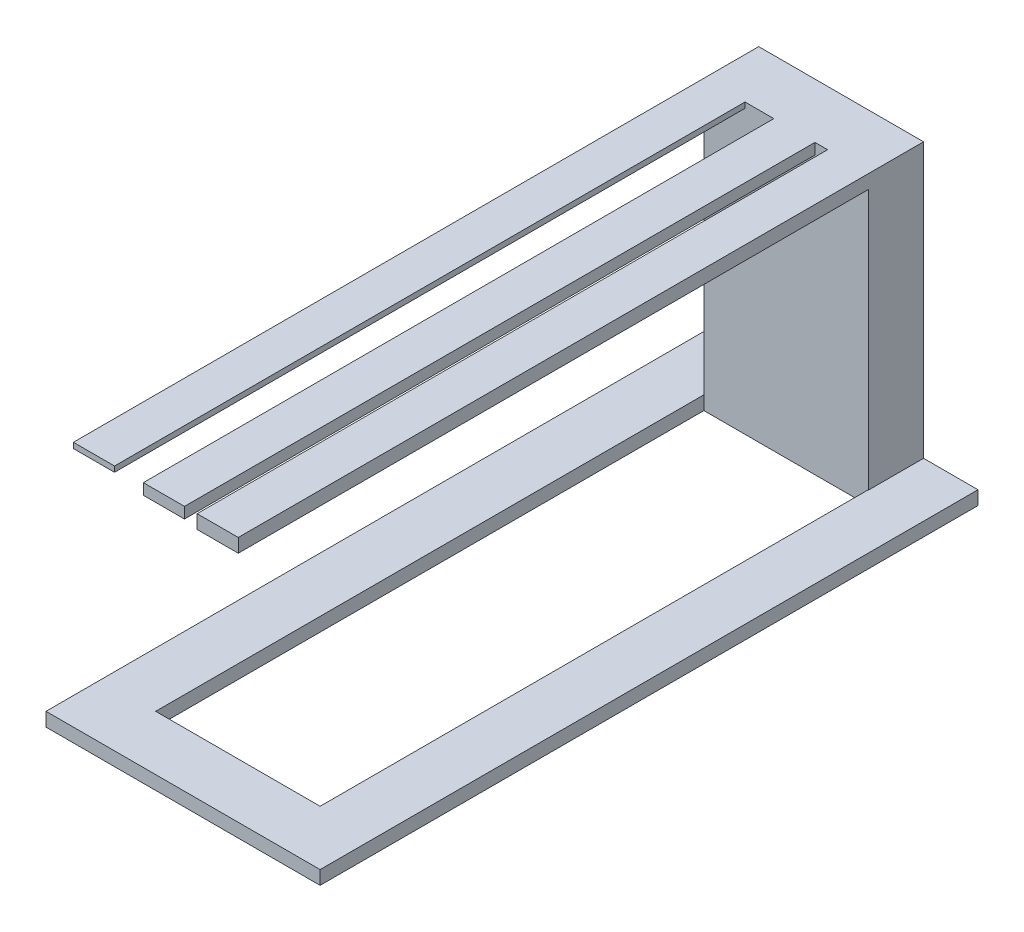
ISO-10303-21;
HEADER;
FILE_DESCRIPTION(('STEP AP214'),'2;1');
FILE_NAME('part.step','',(''),(''),'','','');
FILE_SCHEMA(('AUTOMOTIVE_DESIGN { 1 0 10303 214 1 1 1 1 }'));
ENDSEC;
DATA;
#1=APPLICATION_CONTEXT('core data for automotive mechanical design processes');
#2=APPLICATION_PROTOCOL_DEFINITION('international standard','automotive_design',2000,#1);
#3=PRODUCT_CONTEXT('',#1,'mechanical');
#4=PRODUCT('Part','Part','',(#3));
#5=PRODUCT_RELATED_PRODUCT_CATEGORY('part','',(#4));
#6=PRODUCT_DEFINITION_FORMATION('','',#4);
#7=PRODUCT_DEFINITION_CONTEXT('part definition',#1,'design');
#8=PRODUCT_DEFINITION('design','',#6,#7);
#9=PRODUCT_DEFINITION_SHAPE('','',#8);
#10=(LENGTH_UNIT() NAMED_UNIT(*) SI_UNIT(.MILLI.,.METRE.));
#11=(NAMED_UNIT(*) PLANE_ANGLE_UNIT() SI_UNIT($,.RADIAN.));
#12=(NAMED_UNIT(*) SI_UNIT($,.STERADIAN.) SOLID_ANGLE_UNIT());
#13=UNCERTAINTY_MEASURE_WITH_UNIT(LENGTH_MEASURE(1.E-05),#10,'distance_accuracy_value','');
#14=(GEOMETRIC_REPRESENTATION_CONTEXT(3) GLOBAL_UNCERTAINTY_ASSIGNED_CONTEXT((#13)) GLOBAL_UNIT_ASSIGNED_CONTEXT((#10,
#11,#12)) REPRESENTATION_CONTEXT('',''));
#15=CARTESIAN_POINT('',(0.,0.,0.));
#16=DIRECTION('',(0.,0.,1.));
#17=DIRECTION('',(1.,0.,0.));
#18=AXIS2_PLACEMENT_3D('',#15,#16,#17);
#19=CARTESIAN_POINT('',(0.,5.,-19.4817184539535));
#20=DIRECTION('',(0.,0.,-1.));
#21=DIRECTION('',(-1.,0.,0.));
#22=AXIS2_PLACEMENT_3D('',#19,#20,#21);
#23=PLANE('',#22);
#24=DIRECTION('',(0.,1.,0.));
#25=VECTOR('',#24,1.);
#26=CARTESIAN_POINT('',(13.2134003903269,105.,-19.4817184539535));
#27=LINE('',#26,#25);
#28=CARTESIAN_POINT('',(13.2134003903269,101.,-19.4817184539535));
#29=VERTEX_POINT('',#28);
#30=CARTESIAN_POINT('',(13.2134003903269,105.,-19.4817184539535));
#31=VERTEX_POINT('',#30);
#32=EDGE_CURVE('E58',#29,#31,#27,.T.);
#33=ORIENTED_EDGE('',*,*,#32,.F.);
#34=DIRECTION('',(1.,0.,0.));
#35=VECTOR('',#34,1.);
#36=CARTESIAN_POINT('',(13.2134003903269,101.,-19.4817184539535));
#37=LINE('',#36,#35);
#38=CARTESIAN_POINT('',(-1.78659960967309,101.,-19.4817184539535));
#39=VERTEX_POINT('',#38);
#40=EDGE_CURVE('E194',#39,#29,#37,.T.);
#41=ORIENTED_EDGE('',*,*,#40,.F.);
#42=DIRECTION('',(0.,-1.,0.));
#43=VECTOR('',#42,1.);
#44=CARTESIAN_POINT('',(-1.78659960967309,105.,-19.4817184539535));
#45=LINE('',#44,#43);
#46=CARTESIAN_POINT('',(-1.78659960967309,105.,-19.4817184539535));
#47=VERTEX_POINT('',#46);
#48=EDGE_CURVE('E203',#47,#39,#45,.T.);
#49=ORIENTED_EDGE('',*,*,#48,.F.);
#50=DIRECTION('',(1.,0.,0.));
#51=VECTOR('',#50,1.);
#52=CARTESIAN_POINT('',(-27.2996300863132,105.,-19.4817184539535));
#53=LINE('',#52,#51);
#54=CARTESIAN_POINT('',(-12.2996300863132,105.,-19.4817184539535));
#55=VERTEX_POINT('',#54);
#56=EDGE_CURVE('E268',#55,#47,#53,.T.);
#57=ORIENTED_EDGE('',*,*,#56,.F.);
#58=DIRECTION('',(0.,1.,0.));
#59=VECTOR('',#58,1.);
#60=CARTESIAN_POINT('',(-12.2996300863132,105.,-19.4817184539535));
#61=LINE('',#60,#59);
#62=CARTESIAN_POINT('',(-12.2996300863132,103.,-19.4817184539535));
#63=VERTEX_POINT('',#62);
#64=EDGE_CURVE('E249',#63,#55,#61,.T.);
#65=ORIENTED_EDGE('',*,*,#64,.F.);
#66=DIRECTION('',(1.,0.,0.));
#67=VECTOR('',#66,1.);
#68=CARTESIAN_POINT('',(-27.2996300863132,103.,-19.4817184539535));
#69=LINE('',#68,#67);
#70=CARTESIAN_POINT('',(-27.2996300863132,103.,-19.4817184539535));
#71=VERTEX_POINT('',#70);
#72=EDGE_CURVE('E237',#71,#63,#69,.T.);
#73=ORIENTED_EDGE('',*,*,#72,.F.);
#74=DIRECTION('',(0.,-1.,0.));
#75=VECTOR('',#74,1.);
#76=CARTESIAN_POINT('',(-27.2996300863132,105.,-19.4817184539535));
#77=LINE('',#76,#75);
#78=CARTESIAN_POINT('',(-27.2996300863132,5.,-19.4817184539535));
#79=VERTEX_POINT('',#78);
#80=EDGE_CURVE('E286',#71,#79,#77,.T.);
#81=ORIENTED_EDGE('',*,*,#80,.T.);
#82=DIRECTION('',(0.,-1.,0.));
#83=VECTOR('',#82,1.);
#84=CARTESIAN_POINT('',(-27.2996300863132,5.,-19.4817184539535));
#85=LINE('',#84,#83);
#86=CARTESIAN_POINT('',(-27.2996300863132,0.,-19.4817184539535));
#87=VERTEX_POINT('',#86);
#88=EDGE_CURVE('E336',#79,#87,#85,.T.);
#89=ORIENTED_EDGE('',*,*,#88,.T.);
#90=DIRECTION('',(1.,0.,0.));
#91=VECTOR('',#90,1.);
#92=CARTESIAN_POINT('',(0.,0.,-19.4817184539535));
#93=LINE('',#92,#91);
#94=CARTESIAN_POINT('',(32.7003699136868,0.,-19.4817184539535));
#95=VERTEX_POINT('',#94);
#96=EDGE_CURVE('E326',#87,#95,#93,.T.);
#97=ORIENTED_EDGE('',*,*,#96,.T.);
#98=DIRECTION('',(0.,-1.,0.));
#99=VECTOR('',#98,1.);
#100=CARTESIAN_POINT('',(32.7003699136868,5.,-19.4817184539535));
#101=LINE('',#100,#99);
#102=CARTESIAN_POINT('',(32.7003699136868,5.,-19.4817184539535));
#103=VERTEX_POINT('',#102);
#104=EDGE_CURVE('E333',#103,#95,#101,.T.);
#105=ORIENTED_EDGE('',*,*,#104,.F.);
#106=DIRECTION('',(1.,0.,0.));
#107=VECTOR('',#106,1.);
#108=CARTESIAN_POINT('',(-27.2996300863132,5.,-19.4817184539535));
#109=LINE('',#108,#107);
#110=CARTESIAN_POINT('',(32.8370645417085,5.,-19.4817184539535));
#111=VERTEX_POINT('',#110);
#112=EDGE_CURVE('E11',#103,#111,#109,.T.);
#113=ORIENTED_EDGE('',*,*,#112,.T.);
#114=DIRECTION('',(0.,-1.,0.));
#115=VECTOR('',#114,1.);
#116=CARTESIAN_POINT('',(32.8370645417085,105.,-19.4817184539535));
#117=LINE('',#116,#115);
#118=CARTESIAN_POINT('',(32.8370645417085,100.,-19.4817184539535));
#119=VERTEX_POINT('',#118);
#120=EDGE_CURVE('E284',#119,#111,#117,.T.);
#121=ORIENTED_EDGE('',*,*,#120,.F.);
#122=DIRECTION('',(1.,0.,0.));
#123=VECTOR('',#122,1.);
#124=CARTESIAN_POINT('',(32.8370645417085,100.,-19.4817184539535));
#125=LINE('',#124,#123);
#126=CARTESIAN_POINT('',(17.8370645417085,100.,-19.4817184539535));
#127=VERTEX_POINT('',#126);
#128=EDGE_CURVE('E232',#127,#119,#125,.T.);
#129=ORIENTED_EDGE('',*,*,#128,.F.);
#130=DIRECTION('',(0.,-1.,0.));
#131=VECTOR('',#130,1.);
#132=CARTESIAN_POINT('',(17.8370645417085,105.,-19.4817184539535));
#133=LINE('',#132,#131);
#134=CARTESIAN_POINT('',(17.8370645417085,105.,-19.4817184539535));
#135=VERTEX_POINT('',#134);
#136=EDGE_CURVE('E234',#135,#127,#133,.T.);
#137=ORIENTED_EDGE('',*,*,#136,.F.);
#138=EDGE_CURVE('E212',#31,#135,#53,.T.);
#139=ORIENTED_EDGE('',*,*,#138,.F.);
#140=EDGE_LOOP('',(#33,#41,#49,#57,#65,#73,#81,#89,#97,#105,#113,#121,#129,#137,#139));
#141=FACE_BOUND('',#140,.T.);
#142=ADVANCED_FACE('F41',(#141),#23,.F.);
#143=CARTESIAN_POINT('',(0.,5.,180.518281546047));
#144=DIRECTION('',(0.,0.,-1.));
#145=DIRECTION('',(-1.,0.,0.));
#146=AXIS2_PLACEMENT_3D('',#143,#144,#145);
#147=PLANE('',#146);
#148=DIRECTION('',(1.,0.,0.));
#149=VECTOR('',#148,1.);
#150=CARTESIAN_POINT('',(0.,0.,180.518281546047));
#151=LINE('',#150,#149);
#152=CARTESIAN_POINT('',(-27.2996300863132,0.,180.518281546047));
#153=VERTEX_POINT('',#152);
#154=CARTESIAN_POINT('',(32.7003699136868,0.,180.518281546047));
#155=VERTEX_POINT('',#154);
#156=EDGE_CURVE('E320',#153,#155,#151,.T.);
#157=ORIENTED_EDGE('',*,*,#156,.F.);
#158=DIRECTION('',(0.,-1.,0.));
#159=VECTOR('',#158,1.);
#160=CARTESIAN_POINT('',(-27.2996300863132,5.,180.518281546047));
#161=LINE('',#160,#159);
#162=CARTESIAN_POINT('',(-27.2996300863132,5.,180.518281546047));
#163=VERTEX_POINT('',#162);
#164=EDGE_CURVE('E50',#163,#153,#161,.T.);
#165=ORIENTED_EDGE('',*,*,#164,.F.);
#166=DIRECTION('',(1.,0.,0.));
#167=VECTOR('',#166,1.);
#168=CARTESIAN_POINT('',(0.,5.,180.518281546047));
#169=LINE('',#168,#167);
#170=CARTESIAN_POINT('',(32.7003699136868,5.,180.518281546047));
#171=VERTEX_POINT('',#170);
#172=EDGE_CURVE('E301',#163,#171,#169,.T.);
#173=ORIENTED_EDGE('',*,*,#172,.T.);
#174=DIRECTION('',(0.,-1.,0.));
#175=VECTOR('',#174,1.);
#176=CARTESIAN_POINT('',(32.7003699136868,5.,180.518281546047));
#177=LINE('',#176,#175);
#178=EDGE_CURVE('E331',#171,#155,#177,.T.);
#179=ORIENTED_EDGE('',*,*,#178,.T.);
#180=EDGE_LOOP('',(#157,#165,#173,#179));
#181=FACE_BOUND('',#180,.T.);
#182=ADVANCED_FACE('F428',(#181),#147,.T.);
#183=CARTESIAN_POINT('',(-27.2996300863132,5.,0.));
#184=DIRECTION('',(1.,0.,0.));
#185=DIRECTION('',(0.,0.,-1.));
#186=AXIS2_PLACEMENT_3D('',#183,#184,#185);
#187=PLANE('',#186);
#188=DIRECTION('',(0.,0.,1.));
#189=VECTOR('',#188,1.);
#190=CARTESIAN_POINT('',(-27.2996300863132,0.,0.));
#191=LINE('',#190,#189);
#192=EDGE_CURVE('E323',#87,#153,#191,.T.);
#193=ORIENTED_EDGE('',*,*,#192,.F.);
#194=ORIENTED_EDGE('',*,*,#88,.F.);
#195=DIRECTION('',(0.,0.,1.));
#196=VECTOR('',#195,1.);
#197=CARTESIAN_POINT('',(-27.2996300863132,5.,0.));
#198=LINE('',#197,#196);
#199=EDGE_CURVE('E304',#79,#163,#198,.T.);
#200=ORIENTED_EDGE('',*,*,#199,.T.);
#201=ORIENTED_EDGE('',*,*,#164,.T.);
#202=EDGE_LOOP('',(#193,#194,#200,#201));
#203=FACE_BOUND('',#202,.T.);
#204=ADVANCED_FACE('F426',(#203),#187,.T.);
#205=CARTESIAN_POINT('',(-47.2996300863132,5.,0.));
#206=DIRECTION('',(1.,0.,0.));
#207=DIRECTION('',(0.,0.,-1.));
#208=AXIS2_PLACEMENT_3D('',#205,#206,#207);
#209=PLANE('',#208);
#210=DIRECTION('',(0.,0.,1.));
#211=VECTOR('',#210,1.);
#212=CARTESIAN_POINT('',(-47.2996300863132,0.,0.));
#213=LINE('',#212,#211);
#214=CARTESIAN_POINT('',(-47.2996300863132,0.,-39.4817184539535));
#215=VERTEX_POINT('',#214);
#216=CARTESIAN_POINT('',(-47.2996300863132,0.,200.518281546047));
#217=VERTEX_POINT('',#216);
#218=EDGE_CURVE('E288',#215,#217,#213,.T.);
#219=ORIENTED_EDGE('',*,*,#218,.T.);
#220=DIRECTION('',(0.,-1.,0.));
#221=VECTOR('',#220,1.);
#222=CARTESIAN_POINT('',(-47.2996300863132,5.,200.518281546047));
#223=LINE('',#222,#221);
#224=CARTESIAN_POINT('',(-47.2996300863132,5.,200.518281546047));
#225=VERTEX_POINT('',#224);
#226=EDGE_CURVE('E45',#225,#217,#223,.T.);
#227=ORIENTED_EDGE('',*,*,#226,.F.);
#228=DIRECTION('',(0.,0.,1.));
#229=VECTOR('',#228,1.);
#230=CARTESIAN_POINT('',(-47.2996300863132,5.,0.));
#231=LINE('',#230,#229);
#232=CARTESIAN_POINT('',(-47.2996300863132,5.,-39.4817184539535));
#233=VERTEX_POINT('',#232);
#234=EDGE_CURVE('E289',#233,#225,#231,.T.);
#235=ORIENTED_EDGE('',*,*,#234,.F.);
#236=DIRECTION('',(0.,-1.,0.));
#237=VECTOR('',#236,1.);
#238=CARTESIAN_POINT('',(-47.2996300863132,5.,-39.4817184539535));
#239=LINE('',#238,#237);
#240=EDGE_CURVE('E309',#233,#215,#239,.T.);
#241=ORIENTED_EDGE('',*,*,#240,.T.);
#242=EDGE_LOOP('',(#219,#227,#235,#241));
#243=FACE_BOUND('',#242,.T.);
#244=ADVANCED_FACE('F43',(#243),#209,.F.);
#245=CARTESIAN_POINT('',(0.,5.,200.518281546047));
#246=DIRECTION('',(0.,0.,1.));
#247=DIRECTION('',(1.,0.,0.));
#248=AXIS2_PLACEMENT_3D('',#245,#246,#247);
#249=PLANE('',#248);
#250=DIRECTION('',(-1.,0.,0.));
#251=VECTOR('',#250,1.);
#252=CARTESIAN_POINT('',(0.,0.,200.518281546047));
#253=LINE('',#252,#251);
#254=CARTESIAN_POINT('',(52.7003699136868,0.,200.518281546047));
#255=VERTEX_POINT('',#254);
#256=EDGE_CURVE('E312',#255,#217,#253,.T.);
#257=ORIENTED_EDGE('',*,*,#256,.F.);
#258=DIRECTION('',(0.,-1.,0.));
#259=VECTOR('',#258,1.);
#260=CARTESIAN_POINT('',(52.7003699136868,5.,200.518281546047));
#261=LINE('',#260,#259);
#262=CARTESIAN_POINT('',(52.7003699136868,5.,200.518281546047));
#263=VERTEX_POINT('',#262);
#264=EDGE_CURVE('E342',#263,#255,#261,.T.);
#265=ORIENTED_EDGE('',*,*,#264,.F.);
#266=DIRECTION('',(-1.,0.,0.));
#267=VECTOR('',#266,1.);
#268=CARTESIAN_POINT('',(0.,5.,200.518281546047));
#269=LINE('',#268,#267);
#270=EDGE_CURVE('E291',#263,#225,#269,.T.);
#271=ORIENTED_EDGE('',*,*,#270,.T.);
#272=ORIENTED_EDGE('',*,*,#226,.T.);
#273=EDGE_LOOP('',(#257,#265,#271,#272));
#274=FACE_BOUND('',#273,.T.);
#275=ADVANCED_FACE('F348',(#274),#249,.T.);
#276=CARTESIAN_POINT('',(52.7003699136868,5.,0.));
#277=DIRECTION('',(1.,0.,0.));
#278=DIRECTION('',(0.,0.,-1.));
#279=AXIS2_PLACEMENT_3D('',#276,#277,#278);
#280=PLANE('',#279);
#281=DIRECTION('',(0.,0.,1.));
#282=VECTOR('',#281,1.);
#283=CARTESIAN_POINT('',(52.7003699136868,0.,0.));
#284=LINE('',#283,#282);
#285=CARTESIAN_POINT('',(52.7003699136868,0.,-39.4817184539535));
#286=VERTEX_POINT('',#285);
#287=EDGE_CURVE('E315',#286,#255,#284,.T.);
#288=ORIENTED_EDGE('',*,*,#287,.F.);
#289=DIRECTION('',(0.,-1.,0.));
#290=VECTOR('',#289,1.);
#291=CARTESIAN_POINT('',(52.7003699136868,5.,-39.4817184539535));
#292=LINE('',#291,#290);
#293=CARTESIAN_POINT('',(52.7003699136868,5.,-39.4817184539535));
#294=VERTEX_POINT('',#293);
#295=EDGE_CURVE('E341',#294,#286,#292,.T.);
#296=ORIENTED_EDGE('',*,*,#295,.F.);
#297=DIRECTION('',(0.,0.,1.));
#298=VECTOR('',#297,1.);
#299=CARTESIAN_POINT('',(52.7003699136868,5.,0.));
#300=LINE('',#299,#298);
#301=EDGE_CURVE('E295',#294,#263,#300,.T.);
#302=ORIENTED_EDGE('',*,*,#301,.T.);
#303=ORIENTED_EDGE('',*,*,#264,.T.);
#304=EDGE_LOOP('',(#288,#296,#302,#303));
#305=FACE_BOUND('',#304,.T.);
#306=ADVANCED_FACE('F358',(#305),#280,.T.);
#307=CARTESIAN_POINT('',(0.,5.,-39.4817184539535));
#308=DIRECTION('',(0.,0.,1.));
#309=DIRECTION('',(1.,0.,0.));
#310=AXIS2_PLACEMENT_3D('',#307,#308,#309);
#311=PLANE('',#310);
#312=DIRECTION('',(-1.,0.,0.));
#313=VECTOR('',#312,1.);
#314=CARTESIAN_POINT('',(0.,0.,-39.4817184539535));
#315=LINE('',#314,#313);
#316=EDGE_CURVE('E318',#286,#215,#315,.T.);
#317=ORIENTED_EDGE('',*,*,#316,.T.);
#318=ORIENTED_EDGE('',*,*,#240,.F.);
#319=DIRECTION('',(-1.,0.,0.));
#320=VECTOR('',#319,1.);
#321=CARTESIAN_POINT('',(0.,5.,-39.4817184539535));
#322=LINE('',#321,#320);
#323=CARTESIAN_POINT('',(-27.2996300863132,5.,-39.4817184539535));
#324=VERTEX_POINT('',#323);
#325=EDGE_CURVE('E298',#324,#233,#322,.T.);
#326=ORIENTED_EDGE('',*,*,#325,.F.);
#327=DIRECTION('',(0.,-1.,0.));
#328=VECTOR('',#327,1.);
#329=CARTESIAN_POINT('',(-27.2996300863132,105.,-39.4817184539535));
#330=LINE('',#329,#328);
#331=CARTESIAN_POINT('',(-27.2996300863132,105.,-39.4817184539535));
#332=VERTEX_POINT('',#331);
#333=EDGE_CURVE('E274',#332,#324,#330,.T.);
#334=ORIENTED_EDGE('',*,*,#333,.F.);
#335=DIRECTION('',(-1.,0.,0.));
#336=VECTOR('',#335,1.);
#337=CARTESIAN_POINT('',(-27.2996300863132,105.,-39.4817184539535));
#338=LINE('',#337,#336);
#339=CARTESIAN_POINT('',(32.8370645417085,105.,-39.4817184539535));
#340=VERTEX_POINT('',#339);
#341=EDGE_CURVE('E272',#340,#332,#338,.T.);
#342=ORIENTED_EDGE('',*,*,#341,.F.);
#343=DIRECTION('',(0.,-1.,0.));
#344=VECTOR('',#343,1.);
#345=CARTESIAN_POINT('',(32.8370645417085,105.,-39.4817184539535));
#346=LINE('',#345,#344);
#347=CARTESIAN_POINT('',(32.8370645417085,5.,-39.4817184539535));
#348=VERTEX_POINT('',#347);
#349=EDGE_CURVE('E281',#340,#348,#346,.T.);
#350=ORIENTED_EDGE('',*,*,#349,.T.);
#351=EDGE_CURVE('E299',#294,#348,#322,.T.);
#352=ORIENTED_EDGE('',*,*,#351,.F.);
#353=ORIENTED_EDGE('',*,*,#295,.T.);
#354=EDGE_LOOP('',(#317,#318,#326,#334,#342,#350,#352,#353));
#355=FACE_BOUND('',#354,.T.);
#356=ADVANCED_FACE('F362',(#355),#311,.F.);
#357=CARTESIAN_POINT('',(32.7003699136868,5.,0.));
#358=DIRECTION('',(1.,0.,0.));
#359=DIRECTION('',(0.,0.,-1.));
#360=AXIS2_PLACEMENT_3D('',#357,#358,#359);
#361=PLANE('',#360);
#362=DIRECTION('',(0.,0.,1.));
#363=VECTOR('',#362,1.);
#364=CARTESIAN_POINT('',(32.7003699136868,0.,0.));
#365=LINE('',#364,#363);
#366=EDGE_CURVE('E292',#95,#155,#365,.T.);
#367=ORIENTED_EDGE('',*,*,#366,.T.);
#368=ORIENTED_EDGE('',*,*,#178,.F.);
#369=DIRECTION('',(0.,0.,1.));
#370=VECTOR('',#369,1.);
#371=CARTESIAN_POINT('',(32.7003699136868,5.,0.));
#372=LINE('',#371,#370);
#373=EDGE_CURVE('E307',#103,#171,#372,.T.);
#374=ORIENTED_EDGE('',*,*,#373,.F.);
#375=ORIENTED_EDGE('',*,*,#104,.T.);
#376=EDGE_LOOP('',(#367,#368,#374,#375));
#377=FACE_BOUND('',#376,.T.);
#378=ADVANCED_FACE('F419',(#377),#361,.F.);
#379=CARTESIAN_POINT('',(0.,5.,0.));
#380=DIRECTION('',(0.,1.,0.));
#381=DIRECTION('',(0.,0.,1.));
#382=AXIS2_PLACEMENT_3D('',#379,#380,#381);
#383=PLANE('',#382);
#384=DIRECTION('',(0.,0.,1.));
#385=VECTOR('',#384,1.);
#386=CARTESIAN_POINT('',(-27.2996300863132,5.,-19.4817184539535));
#387=LINE('',#386,#385);
#388=EDGE_CURVE('E264',#324,#79,#387,.T.);
#389=ORIENTED_EDGE('',*,*,#388,.F.);
#390=ORIENTED_EDGE('',*,*,#325,.T.);
#391=ORIENTED_EDGE('',*,*,#234,.T.);
#392=ORIENTED_EDGE('',*,*,#270,.F.);
#393=ORIENTED_EDGE('',*,*,#301,.F.);
#394=ORIENTED_EDGE('',*,*,#351,.T.);
#395=DIRECTION('',(0.,0.,-1.));
#396=VECTOR('',#395,1.);
#397=CARTESIAN_POINT('',(32.8370645417085,5.,-19.4817184539535));
#398=LINE('',#397,#396);
#399=EDGE_CURVE('E267',#111,#348,#398,.T.);
#400=ORIENTED_EDGE('',*,*,#399,.F.);
#401=ORIENTED_EDGE('',*,*,#112,.F.);
#402=ORIENTED_EDGE('',*,*,#373,.T.);
#403=ORIENTED_EDGE('',*,*,#172,.F.);
#404=ORIENTED_EDGE('',*,*,#199,.F.);
#405=EDGE_LOOP('',(#389,#390,#391,#392,#393,#394,#400,#401,#402,#403,#404));
#406=FACE_BOUND('',#405,.T.);
#407=ADVANCED_FACE('F367',(#406),#383,.T.);
#408=CARTESIAN_POINT('',(0.,0.,0.));
#409=DIRECTION('',(0.,1.,0.));
#410=DIRECTION('',(0.,0.,1.));
#411=AXIS2_PLACEMENT_3D('',#408,#409,#410);
#412=PLANE('',#411);
#413=ORIENTED_EDGE('',*,*,#218,.F.);
#414=ORIENTED_EDGE('',*,*,#316,.F.);
#415=ORIENTED_EDGE('',*,*,#287,.T.);
#416=ORIENTED_EDGE('',*,*,#256,.T.);
#417=EDGE_LOOP('',(#413,#414,#415,#416));
#418=FACE_BOUND('',#417,.T.);
#419=ORIENTED_EDGE('',*,*,#156,.T.);
#420=ORIENTED_EDGE('',*,*,#366,.F.);
#421=ORIENTED_EDGE('',*,*,#96,.F.);
#422=ORIENTED_EDGE('',*,*,#192,.T.);
#423=EDGE_LOOP('',(#419,#420,#421,#422));
#424=FACE_BOUND('',#423,.T.);
#425=ADVANCED_FACE('F356',(#418,#424),#412,.F.);
#426=CARTESIAN_POINT('',(-27.2996300863132,105.,-19.4817184539535));
#427=DIRECTION('',(1.,0.,0.));
#428=DIRECTION('',(0.,0.,-1.));
#429=AXIS2_PLACEMENT_3D('',#426,#427,#428);
#430=PLANE('',#429);
#431=ORIENTED_EDGE('',*,*,#388,.T.);
#432=ORIENTED_EDGE('',*,*,#80,.F.);
#433=DIRECTION('',(0.,0.,-1.));
#434=VECTOR('',#433,1.);
#435=CARTESIAN_POINT('',(-27.2996300863132,103.,210.518281546047));
#436=LINE('',#435,#434);
#437=CARTESIAN_POINT('',(-27.2996300863132,103.,210.518281546047));
#438=VERTEX_POINT('',#437);
#439=EDGE_CURVE('E262',#438,#71,#436,.T.);
#440=ORIENTED_EDGE('',*,*,#439,.F.);
#441=DIRECTION('',(0.,-1.,0.));
#442=VECTOR('',#441,1.);
#443=CARTESIAN_POINT('',(-27.2996300863132,105.,210.518281546047));
#444=LINE('',#443,#442);
#445=CARTESIAN_POINT('',(-27.2996300863132,105.,210.518281546047));
#446=VERTEX_POINT('',#445);
#447=EDGE_CURVE('E245',#446,#438,#444,.T.);
#448=ORIENTED_EDGE('',*,*,#447,.F.);
#449=DIRECTION('',(0.,0.,1.));
#450=VECTOR('',#449,1.);
#451=CARTESIAN_POINT('',(-27.2996300863132,105.,-19.4817184539535));
#452=LINE('',#451,#450);
#453=EDGE_CURVE('E265',#332,#446,#452,.T.);
#454=ORIENTED_EDGE('',*,*,#453,.F.);
#455=ORIENTED_EDGE('',*,*,#333,.T.);
#456=EDGE_LOOP('',(#431,#432,#440,#448,#454,#455));
#457=FACE_BOUND('',#456,.T.);
#458=ADVANCED_FACE('F373',(#457),#430,.F.);
#459=CARTESIAN_POINT('',(32.8370645417085,105.,-19.4817184539535));
#460=DIRECTION('',(-1.,0.,0.));
#461=DIRECTION('',(0.,0.,1.));
#462=AXIS2_PLACEMENT_3D('',#459,#460,#461);
#463=PLANE('',#462);
#464=ORIENTED_EDGE('',*,*,#399,.T.);
#465=ORIENTED_EDGE('',*,*,#349,.F.);
#466=DIRECTION('',(0.,0.,-1.));
#467=VECTOR('',#466,1.);
#468=CARTESIAN_POINT('',(32.8370645417085,105.,-19.4817184539535));
#469=LINE('',#468,#467);
#470=CARTESIAN_POINT('',(32.8370645417085,105.,210.518281546047));
#471=VERTEX_POINT('',#470);
#472=EDGE_CURVE('E270',#471,#340,#469,.T.);
#473=ORIENTED_EDGE('',*,*,#472,.F.);
#474=DIRECTION('',(0.,1.,0.));
#475=VECTOR('',#474,1.);
#476=CARTESIAN_POINT('',(32.8370645417085,105.,210.518281546047));
#477=LINE('',#476,#475);
#478=CARTESIAN_POINT('',(32.8370645417085,100.,210.518281546047));
#479=VERTEX_POINT('',#478);
#480=EDGE_CURVE('E235',#479,#471,#477,.T.);
#481=ORIENTED_EDGE('',*,*,#480,.F.);
#482=DIRECTION('',(0.,0.,-1.));
#483=VECTOR('',#482,1.);
#484=CARTESIAN_POINT('',(32.8370645417085,100.,210.518281546047));
#485=LINE('',#484,#483);
#486=EDGE_CURVE('E228',#479,#119,#485,.T.);
#487=ORIENTED_EDGE('',*,*,#486,.T.);
#488=ORIENTED_EDGE('',*,*,#120,.T.);
#489=EDGE_LOOP('',(#464,#465,#473,#481,#487,#488));
#490=FACE_BOUND('',#489,.T.);
#491=ADVANCED_FACE('F412',(#490),#463,.F.);
#492=CARTESIAN_POINT('',(0.,105.,0.));
#493=DIRECTION('',(0.,-1.,0.));
#494=DIRECTION('',(0.,0.,-1.));
#495=AXIS2_PLACEMENT_3D('',#492,#493,#494);
#496=PLANE('',#495);
#497=ORIENTED_EDGE('',*,*,#453,.T.);
#498=DIRECTION('',(-1.,0.,0.));
#499=VECTOR('',#498,1.);
#500=CARTESIAN_POINT('',(-27.2996300863132,105.,210.518281546047));
#501=LINE('',#500,#499);
#502=CARTESIAN_POINT('',(-12.2996300863132,105.,210.518281546047));
#503=VERTEX_POINT('',#502);
#504=EDGE_CURVE('E253',#503,#446,#501,.T.);
#505=ORIENTED_EDGE('',*,*,#504,.F.);
#506=DIRECTION('',(0.,0.,-1.));
#507=VECTOR('',#506,1.);
#508=CARTESIAN_POINT('',(-12.2996300863132,105.,210.518281546047));
#509=LINE('',#508,#507);
#510=EDGE_CURVE('E66',#503,#55,#509,.T.);
#511=ORIENTED_EDGE('',*,*,#510,.T.);
#512=ORIENTED_EDGE('',*,*,#56,.T.);
#513=DIRECTION('',(0.,0.,-1.));
#514=VECTOR('',#513,1.);
#515=CARTESIAN_POINT('',(-1.78659960967309,105.,210.518281546047));
#516=LINE('',#515,#514);
#517=CARTESIAN_POINT('',(-1.78659960967309,105.,210.518281546047));
#518=VERTEX_POINT('',#517);
#519=EDGE_CURVE('E388',#518,#47,#516,.T.);
#520=ORIENTED_EDGE('',*,*,#519,.F.);
#521=DIRECTION('',(-1.,0.,0.));
#522=VECTOR('',#521,1.);
#523=CARTESIAN_POINT('',(13.2134003903269,105.,210.518281546047));
#524=LINE('',#523,#522);
#525=CARTESIAN_POINT('',(13.2134003903269,105.,210.518281546047));
#526=VERTEX_POINT('',#525);
#527=EDGE_CURVE('E223',#526,#518,#524,.T.);
#528=ORIENTED_EDGE('',*,*,#527,.F.);
#529=DIRECTION('',(0.,0.,-1.));
#530=VECTOR('',#529,1.);
#531=CARTESIAN_POINT('',(13.2134003903269,105.,210.518281546047));
#532=LINE('',#531,#530);
#533=EDGE_CURVE('E391',#526,#31,#532,.T.);
#534=ORIENTED_EDGE('',*,*,#533,.T.);
#535=ORIENTED_EDGE('',*,*,#138,.T.);
#536=DIRECTION('',(0.,0.,-1.));
#537=VECTOR('',#536,1.);
#538=CARTESIAN_POINT('',(17.8370645417085,105.,210.518281546047));
#539=LINE('',#538,#537);
#540=CARTESIAN_POINT('',(17.8370645417085,105.,210.518281546047));
#541=VERTEX_POINT('',#540);
#542=EDGE_CURVE('E213',#541,#135,#539,.T.);
#543=ORIENTED_EDGE('',*,*,#542,.F.);
#544=DIRECTION('',(-1.,0.,0.));
#545=VECTOR('',#544,1.);
#546=CARTESIAN_POINT('',(32.8370645417085,105.,210.518281546047));
#547=LINE('',#546,#545);
#548=EDGE_CURVE('E241',#471,#541,#547,.T.);
#549=ORIENTED_EDGE('',*,*,#548,.F.);
#550=ORIENTED_EDGE('',*,*,#472,.T.);
#551=ORIENTED_EDGE('',*,*,#341,.T.);
#552=EDGE_LOOP('',(#497,#505,#511,#512,#520,#528,#534,#535,#543,#549,#550,#551));
#553=FACE_BOUND('',#552,.T.);
#554=ADVANCED_FACE('F377',(#553),#496,.F.);
#555=CARTESIAN_POINT('',(-27.2996300863132,103.,210.518281546047));
#556=DIRECTION('',(0.,1.,0.));
#557=DIRECTION('',(0.,0.,1.));
#558=AXIS2_PLACEMENT_3D('',#555,#556,#557);
#559=PLANE('',#558);
#560=ORIENTED_EDGE('',*,*,#72,.T.);
#561=DIRECTION('',(0.,0.,-1.));
#562=VECTOR('',#561,1.);
#563=CARTESIAN_POINT('',(-12.2996300863132,103.,210.518281546047));
#564=LINE('',#563,#562);
#565=CARTESIAN_POINT('',(-12.2996300863132,103.,210.518281546047));
#566=VERTEX_POINT('',#565);
#567=EDGE_CURVE('E259',#566,#63,#564,.T.);
#568=ORIENTED_EDGE('',*,*,#567,.F.);
#569=DIRECTION('',(1.,0.,0.));
#570=VECTOR('',#569,1.);
#571=CARTESIAN_POINT('',(-27.2996300863132,103.,210.518281546047));
#572=LINE('',#571,#570);
#573=EDGE_CURVE('E248',#438,#566,#572,.T.);
#574=ORIENTED_EDGE('',*,*,#573,.F.);
#575=ORIENTED_EDGE('',*,*,#439,.T.);
#576=EDGE_LOOP('',(#560,#568,#574,#575));
#577=FACE_BOUND('',#576,.T.);
#578=ADVANCED_FACE('F504',(#577),#559,.F.);
#579=CARTESIAN_POINT('',(-12.2996300863132,105.,210.518281546047));
#580=DIRECTION('',(-1.,0.,0.));
#581=DIRECTION('',(0.,0.,1.));
#582=AXIS2_PLACEMENT_3D('',#579,#580,#581);
#583=PLANE('',#582);
#584=ORIENTED_EDGE('',*,*,#64,.T.);
#585=ORIENTED_EDGE('',*,*,#510,.F.);
#586=DIRECTION('',(0.,1.,0.));
#587=VECTOR('',#586,1.);
#588=CARTESIAN_POINT('',(-12.2996300863132,105.,210.518281546047));
#589=LINE('',#588,#587);
#590=EDGE_CURVE('E251',#566,#503,#589,.T.);
#591=ORIENTED_EDGE('',*,*,#590,.F.);
#592=ORIENTED_EDGE('',*,*,#567,.T.);
#593=EDGE_LOOP('',(#584,#585,#591,#592));
#594=FACE_BOUND('',#593,.T.);
#595=ADVANCED_FACE('F383',(#594),#583,.F.);
#596=CARTESIAN_POINT('',(0.,0.,210.518281546047));
#597=DIRECTION('',(0.,0.,1.));
#598=DIRECTION('',(1.,0.,0.));
#599=AXIS2_PLACEMENT_3D('',#596,#597,#598);
#600=PLANE('',#599);
#601=ORIENTED_EDGE('',*,*,#447,.T.);
#602=ORIENTED_EDGE('',*,*,#573,.T.);
#603=ORIENTED_EDGE('',*,*,#590,.T.);
#604=ORIENTED_EDGE('',*,*,#504,.T.);
#605=EDGE_LOOP('',(#601,#602,#603,#604));
#606=FACE_BOUND('',#605,.T.);
#607=ADVANCED_FACE('F379',(#606),#600,.T.);
#608=CARTESIAN_POINT('',(17.8370645417085,105.,210.518281546047));
#609=DIRECTION('',(1.,0.,0.));
#610=DIRECTION('',(0.,0.,-1.));
#611=AXIS2_PLACEMENT_3D('',#608,#609,#610);
#612=PLANE('',#611);
#613=ORIENTED_EDGE('',*,*,#136,.T.);
#614=DIRECTION('',(0.,0.,-1.));
#615=VECTOR('',#614,1.);
#616=CARTESIAN_POINT('',(17.8370645417085,100.,210.518281546047));
#617=LINE('',#616,#615);
#618=CARTESIAN_POINT('',(17.8370645417085,100.,210.518281546047));
#619=VERTEX_POINT('',#618);
#620=EDGE_CURVE('E216',#619,#127,#617,.T.);
#621=ORIENTED_EDGE('',*,*,#620,.F.);
#622=DIRECTION('',(0.,-1.,0.));
#623=VECTOR('',#622,1.);
#624=CARTESIAN_POINT('',(17.8370645417085,105.,210.518281546047));
#625=LINE('',#624,#623);
#626=EDGE_CURVE('E239',#541,#619,#625,.T.);
#627=ORIENTED_EDGE('',*,*,#626,.F.);
#628=ORIENTED_EDGE('',*,*,#542,.T.);
#629=EDGE_LOOP('',(#613,#621,#627,#628));
#630=FACE_BOUND('',#629,.T.);
#631=ADVANCED_FACE('F402',(#630),#612,.F.);
#632=CARTESIAN_POINT('',(32.8370645417085,100.,210.518281546047));
#633=DIRECTION('',(0.,1.,0.));
#634=DIRECTION('',(0.,0.,1.));
#635=AXIS2_PLACEMENT_3D('',#632,#633,#634);
#636=PLANE('',#635);
#637=ORIENTED_EDGE('',*,*,#128,.T.);
#638=ORIENTED_EDGE('',*,*,#486,.F.);
#639=DIRECTION('',(1.,0.,0.));
#640=VECTOR('',#639,1.);
#641=CARTESIAN_POINT('',(32.8370645417085,100.,210.518281546047));
#642=LINE('',#641,#640);
#643=EDGE_CURVE('E231',#619,#479,#642,.T.);
#644=ORIENTED_EDGE('',*,*,#643,.F.);
#645=ORIENTED_EDGE('',*,*,#620,.T.);
#646=EDGE_LOOP('',(#637,#638,#644,#645));
#647=FACE_BOUND('',#646,.T.);
#648=ADVANCED_FACE('F408',(#647),#636,.F.);
#649=CARTESIAN_POINT('',(0.,0.,210.518281546047));
#650=DIRECTION('',(0.,0.,-1.));
#651=DIRECTION('',(-1.,0.,0.));
#652=AXIS2_PLACEMENT_3D('',#649,#650,#651);
#653=PLANE('',#652);
#654=ORIENTED_EDGE('',*,*,#480,.T.);
#655=ORIENTED_EDGE('',*,*,#548,.T.);
#656=ORIENTED_EDGE('',*,*,#626,.T.);
#657=ORIENTED_EDGE('',*,*,#643,.T.);
#658=EDGE_LOOP('',(#654,#655,#656,#657));
#659=FACE_BOUND('',#658,.T.);
#660=ADVANCED_FACE('F414',(#659),#653,.F.);
#661=CARTESIAN_POINT('',(13.2134003903269,105.,210.518281546047));
#662=DIRECTION('',(-1.,0.,0.));
#663=DIRECTION('',(0.,0.,1.));
#664=AXIS2_PLACEMENT_3D('',#661,#662,#663);
#665=PLANE('',#664);
#666=ORIENTED_EDGE('',*,*,#32,.T.);
#667=ORIENTED_EDGE('',*,*,#533,.F.);
#668=DIRECTION('',(0.,1.,0.));
#669=VECTOR('',#668,1.);
#670=CARTESIAN_POINT('',(13.2134003903269,105.,210.518281546047));
#671=LINE('',#670,#669);
#672=CARTESIAN_POINT('',(13.2134003903269,101.,210.518281546047));
#673=VERTEX_POINT('',#672);
#674=EDGE_CURVE('E204',#673,#526,#671,.T.);
#675=ORIENTED_EDGE('',*,*,#674,.F.);
#676=DIRECTION('',(0.,0.,-1.));
#677=VECTOR('',#676,1.);
#678=CARTESIAN_POINT('',(13.2134003903269,101.,210.518281546047));
#679=LINE('',#678,#677);
#680=EDGE_CURVE('E197',#673,#29,#679,.T.);
#681=ORIENTED_EDGE('',*,*,#680,.T.);
#682=EDGE_LOOP('',(#666,#667,#675,#681));
#683=FACE_BOUND('',#682,.T.);
#684=ADVANCED_FACE('F206',(#683),#665,.F.);
#685=CARTESIAN_POINT('',(-1.78659960967309,105.,210.518281546047));
#686=DIRECTION('',(1.,0.,0.));
#687=DIRECTION('',(0.,1.,0.));
#688=AXIS2_PLACEMENT_3D('',#685,#686,#687);
#689=PLANE('',#688);
#690=ORIENTED_EDGE('',*,*,#48,.T.);
#691=DIRECTION('',(0.,0.,-1.));
#692=VECTOR('',#691,1.);
#693=CARTESIAN_POINT('',(-1.78659960967309,101.,210.518281546047));
#694=LINE('',#693,#692);
#695=CARTESIAN_POINT('',(-1.78659960967309,101.,210.518281546047));
#696=VERTEX_POINT('',#695);
#697=EDGE_CURVE('E200',#696,#39,#694,.T.);
#698=ORIENTED_EDGE('',*,*,#697,.F.);
#699=DIRECTION('',(0.,-1.,0.));
#700=VECTOR('',#699,1.);
#701=CARTESIAN_POINT('',(-1.78659960967309,105.,210.518281546047));
#702=LINE('',#701,#700);
#703=EDGE_CURVE('E221',#518,#696,#702,.T.);
#704=ORIENTED_EDGE('',*,*,#703,.F.);
#705=ORIENTED_EDGE('',*,*,#519,.T.);
#706=EDGE_LOOP('',(#690,#698,#704,#705));
#707=FACE_BOUND('',#706,.T.);
#708=ADVANCED_FACE('F393',(#707),#689,.F.);
#709=CARTESIAN_POINT('',(13.2134003903269,101.,210.518281546047));
#710=DIRECTION('',(0.,1.,0.));
#711=DIRECTION('',(0.,0.,1.));
#712=AXIS2_PLACEMENT_3D('',#709,#710,#711);
#713=PLANE('',#712);
#714=ORIENTED_EDGE('',*,*,#40,.T.);
#715=ORIENTED_EDGE('',*,*,#680,.F.);
#716=DIRECTION('',(1.,0.,0.));
#717=VECTOR('',#716,1.);
#718=CARTESIAN_POINT('',(13.2134003903269,101.,210.518281546047));
#719=LINE('',#718,#717);
#720=EDGE_CURVE('E208',#696,#673,#719,.T.);
#721=ORIENTED_EDGE('',*,*,#720,.F.);
#722=ORIENTED_EDGE('',*,*,#697,.T.);
#723=EDGE_LOOP('',(#714,#715,#721,#722));
#724=FACE_BOUND('',#723,.T.);
#725=ADVANCED_FACE('F195',(#724),#713,.F.);
#726=CARTESIAN_POINT('',(0.,0.,210.518281546047));
#727=DIRECTION('',(0.,0.,-1.));
#728=DIRECTION('',(-1.,0.,0.));
#729=AXIS2_PLACEMENT_3D('',#726,#727,#728);
#730=PLANE('',#729);
#731=ORIENTED_EDGE('',*,*,#674,.T.);
#732=ORIENTED_EDGE('',*,*,#527,.T.);
#733=ORIENTED_EDGE('',*,*,#703,.T.);
#734=ORIENTED_EDGE('',*,*,#720,.T.);
#735=EDGE_LOOP('',(#731,#732,#733,#734));
#736=FACE_BOUND('',#735,.T.);
#737=ADVANCED_FACE('F395',(#736),#730,.F.);
#738=CLOSED_SHELL('',(#142,#182,#204,#244,#275,#306,#356,#378,#407,#425,#458,#491,#554,#578,
#595,#607,#631,#648,#660,#684,#708,#725,#737));
#739=MANIFOLD_SOLID_BREP('B2',#738);
#740=ADVANCED_BREP_SHAPE_REPRESENTATION('',(#18,#739),#14);
#741=SHAPE_DEFINITION_REPRESENTATION(#9,#740);
ENDSEC;
END-ISO-10303-21;
